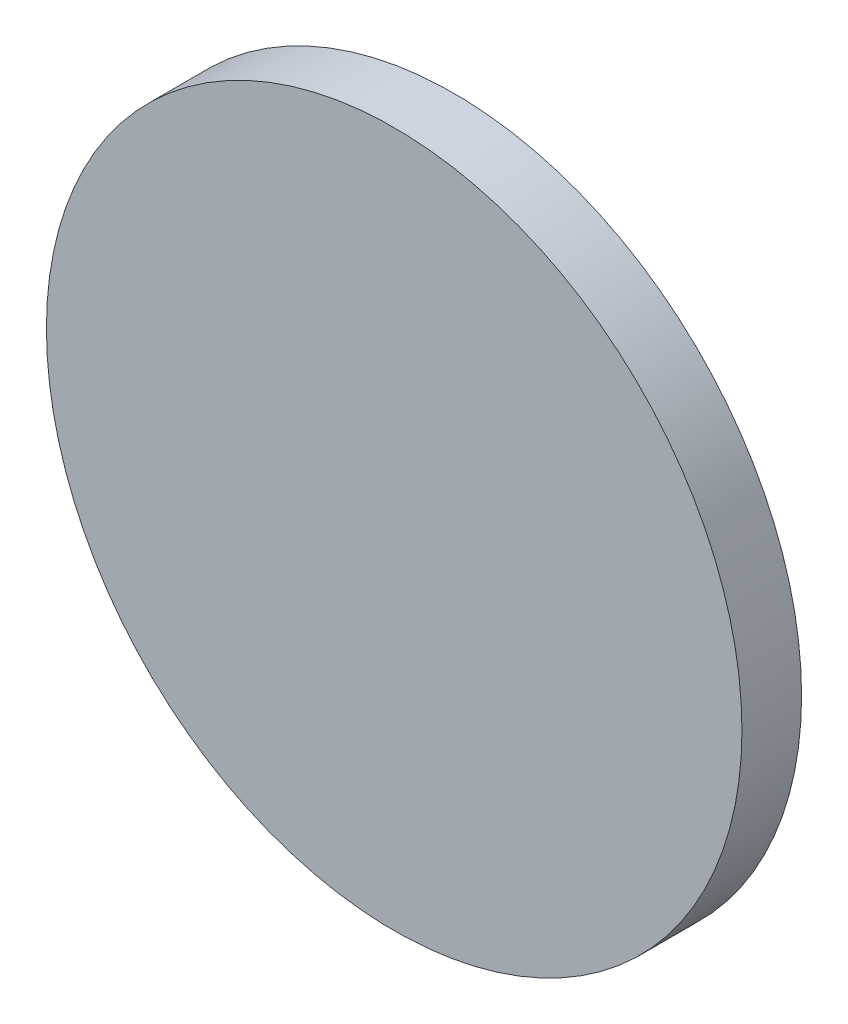
ISO-10303-21;
HEADER;
FILE_DESCRIPTION(('STEP AP214'),'2;1');
FILE_NAME('part.step','',(''),(''),'','','');
FILE_SCHEMA(('AUTOMOTIVE_DESIGN { 1 0 10303 214 1 1 1 1 }'));
ENDSEC;
DATA;
#1=APPLICATION_CONTEXT('core data for automotive mechanical design processes');
#2=APPLICATION_PROTOCOL_DEFINITION('international standard','automotive_design',2000,#1);
#3=PRODUCT_CONTEXT('',#1,'mechanical');
#4=PRODUCT('Part','Part','',(#3));
#5=PRODUCT_RELATED_PRODUCT_CATEGORY('part','',(#4));
#6=PRODUCT_DEFINITION_FORMATION('','',#4);
#7=PRODUCT_DEFINITION_CONTEXT('part definition',#1,'design');
#8=PRODUCT_DEFINITION('design','',#6,#7);
#9=PRODUCT_DEFINITION_SHAPE('','',#8);
#10=(LENGTH_UNIT() NAMED_UNIT(*) SI_UNIT(.MILLI.,.METRE.));
#11=(NAMED_UNIT(*) PLANE_ANGLE_UNIT() SI_UNIT($,.RADIAN.));
#12=(NAMED_UNIT(*) SI_UNIT($,.STERADIAN.) SOLID_ANGLE_UNIT());
#13=UNCERTAINTY_MEASURE_WITH_UNIT(LENGTH_MEASURE(1.E-05),#10,'distance_accuracy_value','');
#14=(GEOMETRIC_REPRESENTATION_CONTEXT(3) GLOBAL_UNCERTAINTY_ASSIGNED_CONTEXT((#13)) GLOBAL_UNIT_ASSIGNED_CONTEXT((#10,
#11,#12)) REPRESENTATION_CONTEXT('',''));
#15=CARTESIAN_POINT('',(0.,0.,0.));
#16=DIRECTION('',(0.,0.,1.));
#17=DIRECTION('',(1.,0.,0.));
#18=AXIS2_PLACEMENT_3D('',#15,#16,#17);
#19=CARTESIAN_POINT('',(11.539,2.991000014875,0.76487));
#20=DIRECTION('',(0.,0.,-1.));
#21=DIRECTION('',(-1.,0.,0.));
#22=AXIS2_PLACEMENT_3D('',#19,#20,#21);
#23=PLANE('',#22);
#24=CARTESIAN_POINT('',(11.539,2.991000014875,0.76487));
#25=DIRECTION('',(0.,0.,1.));
#26=DIRECTION('',(1.,0.,0.));
#27=AXIS2_PLACEMENT_3D('',#24,#25,#26);
#28=CIRCLE('',#27,0.200024667);
#29=CARTESIAN_POINT('',(11.739024667,2.991000014875,0.76487));
#30=VERTEX_POINT('',#29);
#31=EDGE_CURVE('E18',#30,#30,#28,.T.);
#32=ORIENTED_EDGE('',*,*,#31,.F.);
#33=EDGE_LOOP('',(#32));
#34=FACE_BOUND('',#33,.T.);
#35=ADVANCED_FACE('F15',(#34),#23,.T.);
#36=CARTESIAN_POINT('',(11.539,2.991000014875,0.76487));
#37=DIRECTION('',(0.,0.,1.));
#38=DIRECTION('',(1.,0.,0.));
#39=AXIS2_PLACEMENT_3D('',#36,#37,#38);
#40=CYLINDRICAL_SURFACE('',#39,0.200024667);
#41=CARTESIAN_POINT('',(11.539,2.991000014875,0.79916));
#42=DIRECTION('',(0.,0.,1.));
#43=DIRECTION('',(1.,0.,0.));
#44=AXIS2_PLACEMENT_3D('',#41,#42,#43);
#45=CIRCLE('',#44,0.200024667);
#46=CARTESIAN_POINT('',(11.739024667,2.991000014875,0.79916));
#47=VERTEX_POINT('',#46);
#48=EDGE_CURVE('E10',#47,#47,#45,.T.);
#49=ORIENTED_EDGE('',*,*,#48,.F.);
#50=EDGE_LOOP('',(#49));
#51=FACE_BOUND('',#50,.T.);
#52=ORIENTED_EDGE('',*,*,#31,.T.);
#53=EDGE_LOOP('',(#52));
#54=FACE_BOUND('',#53,.T.);
#55=ADVANCED_FACE('F27',(#51,#54),#40,.T.);
#56=CARTESIAN_POINT('',(11.539,2.991000014875,0.79916));
#57=DIRECTION('',(0.,0.,1.));
#58=DIRECTION('',(1.,0.,0.));
#59=AXIS2_PLACEMENT_3D('',#56,#57,#58);
#60=PLANE('',#59);
#61=ORIENTED_EDGE('',*,*,#48,.T.);
#62=EDGE_LOOP('',(#61));
#63=FACE_BOUND('',#62,.T.);
#64=ADVANCED_FACE('F34',(#63),#60,.T.);
#65=CLOSED_SHELL('',(#35,#55,#64));
#66=MANIFOLD_SOLID_BREP('B1',#65);
#67=ADVANCED_BREP_SHAPE_REPRESENTATION('',(#18,#66),#14);
#68=SHAPE_DEFINITION_REPRESENTATION(#9,#67);
ENDSEC;
END-ISO-10303-21;
